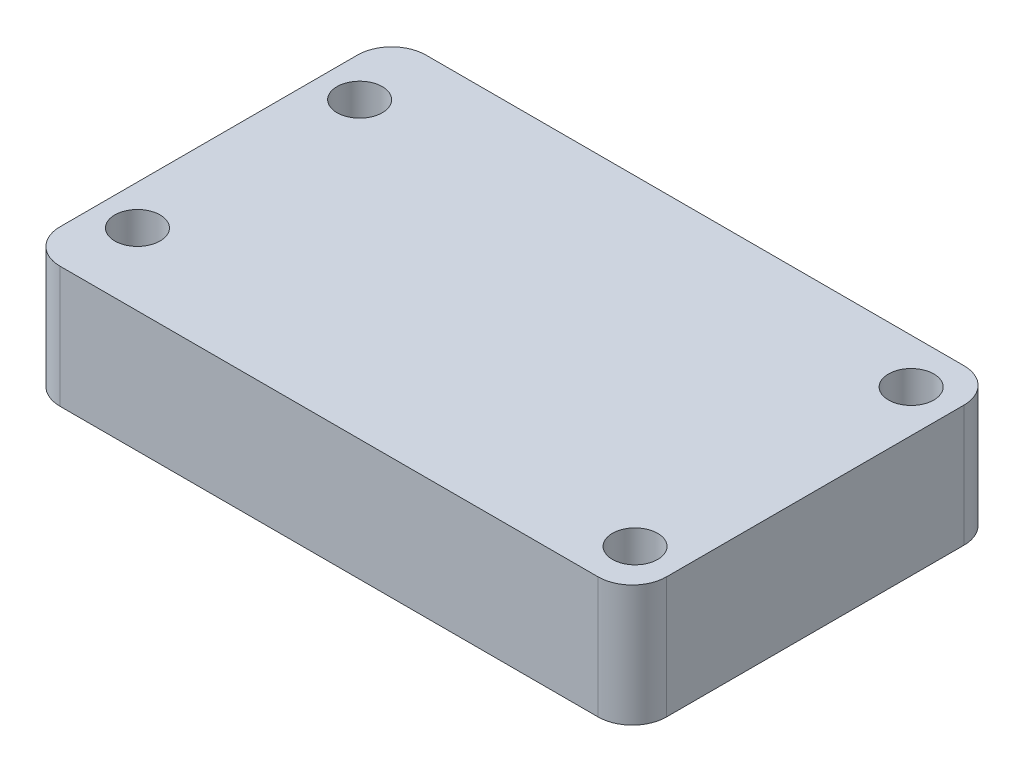
ISO-10303-21;
HEADER;
FILE_DESCRIPTION(('STEP AP214'),'2;1');
FILE_NAME('part.step','',(''),(''),'','','');
FILE_SCHEMA(('AUTOMOTIVE_DESIGN { 1 0 10303 214 1 1 1 1 }'));
ENDSEC;
DATA;
#1=APPLICATION_CONTEXT('core data for automotive mechanical design processes');
#2=APPLICATION_PROTOCOL_DEFINITION('international standard','automotive_design',2000,#1);
#3=PRODUCT_CONTEXT('',#1,'mechanical');
#4=PRODUCT('Part','Part','',(#3));
#5=PRODUCT_RELATED_PRODUCT_CATEGORY('part','',(#4));
#6=PRODUCT_DEFINITION_FORMATION('','',#4);
#7=PRODUCT_DEFINITION_CONTEXT('part definition',#1,'design');
#8=PRODUCT_DEFINITION('design','',#6,#7);
#9=PRODUCT_DEFINITION_SHAPE('','',#8);
#10=(LENGTH_UNIT() NAMED_UNIT(*) SI_UNIT(.MILLI.,.METRE.));
#11=(NAMED_UNIT(*) PLANE_ANGLE_UNIT() SI_UNIT($,.RADIAN.));
#12=(NAMED_UNIT(*) SI_UNIT($,.STERADIAN.) SOLID_ANGLE_UNIT());
#13=UNCERTAINTY_MEASURE_WITH_UNIT(LENGTH_MEASURE(1.E-05),#10,'distance_accuracy_value','');
#14=(GEOMETRIC_REPRESENTATION_CONTEXT(3) GLOBAL_UNCERTAINTY_ASSIGNED_CONTEXT((#13)) GLOBAL_UNIT_ASSIGNED_CONTEXT((#10,
#11,#12)) REPRESENTATION_CONTEXT('',''));
#15=CARTESIAN_POINT('',(0.,0.,0.));
#16=DIRECTION('',(0.,0.,1.));
#17=DIRECTION('',(1.,0.,0.));
#18=AXIS2_PLACEMENT_3D('',#15,#16,#17);
#19=CARTESIAN_POINT('',(-91.4484356685208,7.2136,9.35669322477144));
#20=DIRECTION('',(1.,0.,0.));
#21=DIRECTION('',(0.,0.,-1.));
#22=AXIS2_PLACEMENT_3D('',#19,#20,#21);
#23=PLANE('',#22);
#24=DIRECTION('',(0.,0.,1.));
#25=VECTOR('',#24,1.);
#26=CARTESIAN_POINT('',(-91.4484356685208,0.,9.35669322477144));
#27=LINE('',#26,#25);
#28=CARTESIAN_POINT('',(-91.4484356685208,0.,-10.3537067752286));
#29=VERTEX_POINT('',#28);
#30=CARTESIAN_POINT('',(-91.4484356685208,0.,7.32469322477144));
#31=VERTEX_POINT('',#30);
#32=EDGE_CURVE('E128',#29,#31,#27,.T.);
#33=ORIENTED_EDGE('',*,*,#32,.T.);
#34=DIRECTION('',(0.,-1.,0.));
#35=VECTOR('',#34,1.);
#36=CARTESIAN_POINT('',(-91.4484356685208,7.2136,7.32469322477144));
#37=LINE('',#36,#35);
#38=CARTESIAN_POINT('',(-91.4484356685208,7.2136,7.32469322477144));
#39=VERTEX_POINT('',#38);
#40=EDGE_CURVE('E11',#31,#39,#37,.F.);
#41=ORIENTED_EDGE('',*,*,#40,.T.);
#42=DIRECTION('',(0.,0.,1.));
#43=VECTOR('',#42,1.);
#44=CARTESIAN_POINT('',(-91.4484356685208,7.2136,9.35669322477144));
#45=LINE('',#44,#43);
#46=CARTESIAN_POINT('',(-91.4484356685208,7.2136,-10.3537067752286));
#47=VERTEX_POINT('',#46);
#48=EDGE_CURVE('E126',#47,#39,#45,.T.);
#49=ORIENTED_EDGE('',*,*,#48,.F.);
#50=DIRECTION('',(0.,-1.,0.));
#51=VECTOR('',#50,1.);
#52=CARTESIAN_POINT('',(-91.4484356685208,7.2136,-10.3537067752286));
#53=LINE('',#52,#51);
#54=EDGE_CURVE('E40',#47,#29,#53,.T.);
#55=ORIENTED_EDGE('',*,*,#54,.T.);
#56=EDGE_LOOP('',(#33,#41,#49,#55));
#57=FACE_BOUND('',#56,.T.);
#58=ADVANCED_FACE('F32',(#57),#23,.F.);
#59=CARTESIAN_POINT('',(-91.4484356685208,7.2136,9.35669322477144));
#60=DIRECTION('',(0.,0.,-1.));
#61=DIRECTION('',(-1.,0.,0.));
#62=AXIS2_PLACEMENT_3D('',#59,#60,#61);
#63=PLANE('',#62);
#64=DIRECTION('',(1.,0.,0.));
#65=VECTOR('',#64,1.);
#66=CARTESIAN_POINT('',(-91.4484356685208,0.,9.35669322477144));
#67=LINE('',#66,#65);
#68=CARTESIAN_POINT('',(-89.4164356685208,0.,9.35669322477144));
#69=VERTEX_POINT('',#68);
#70=CARTESIAN_POINT('',(-57.4378356685208,0.,9.35669322477144));
#71=VERTEX_POINT('',#70);
#72=EDGE_CURVE('E124',#69,#71,#67,.T.);
#73=ORIENTED_EDGE('',*,*,#72,.T.);
#74=DIRECTION('',(0.,-1.,0.));
#75=VECTOR('',#74,1.);
#76=CARTESIAN_POINT('',(-57.4378356685208,7.2136,9.35669322477144));
#77=LINE('',#76,#75);
#78=CARTESIAN_POINT('',(-57.4378356685208,7.2136,9.35669322477144));
#79=VERTEX_POINT('',#78);
#80=EDGE_CURVE('E103',#71,#79,#77,.F.);
#81=ORIENTED_EDGE('',*,*,#80,.T.);
#82=DIRECTION('',(1.,0.,0.));
#83=VECTOR('',#82,1.);
#84=CARTESIAN_POINT('',(-91.4484356685208,7.2136,9.35669322477144));
#85=LINE('',#84,#83);
#86=CARTESIAN_POINT('',(-89.4164356685208,7.2136,9.35669322477144));
#87=VERTEX_POINT('',#86);
#88=EDGE_CURVE('E168',#87,#79,#85,.T.);
#89=ORIENTED_EDGE('',*,*,#88,.F.);
#90=DIRECTION('',(0.,-1.,0.));
#91=VECTOR('',#90,1.);
#92=CARTESIAN_POINT('',(-89.4164356685208,7.2136,9.35669322477144));
#93=LINE('',#92,#91);
#94=EDGE_CURVE('E108',#87,#69,#93,.T.);
#95=ORIENTED_EDGE('',*,*,#94,.T.);
#96=EDGE_LOOP('',(#73,#81,#89,#95));
#97=FACE_BOUND('',#96,.T.);
#98=ADVANCED_FACE('F216',(#97),#63,.F.);
#99=CARTESIAN_POINT('',(-55.4058356685208,7.2136,9.35669322477144));
#100=DIRECTION('',(-1.,0.,0.));
#101=DIRECTION('',(0.,0.,1.));
#102=AXIS2_PLACEMENT_3D('',#99,#100,#101);
#103=PLANE('',#102);
#104=DIRECTION('',(0.,0.,-1.));
#105=VECTOR('',#104,1.);
#106=CARTESIAN_POINT('',(-55.4058356685208,7.2136,9.35669322477144));
#107=LINE('',#106,#105);
#108=CARTESIAN_POINT('',(-55.4058356685208,7.2136,7.32469322477144));
#109=VERTEX_POINT('',#108);
#110=CARTESIAN_POINT('',(-55.4058356685208,7.2136,-10.3537067752286));
#111=VERTEX_POINT('',#110);
#112=EDGE_CURVE('E117',#109,#111,#107,.T.);
#113=ORIENTED_EDGE('',*,*,#112,.F.);
#114=DIRECTION('',(0.,-1.,0.));
#115=VECTOR('',#114,1.);
#116=CARTESIAN_POINT('',(-55.4058356685208,7.2136,7.32469322477144));
#117=LINE('',#116,#115);
#118=CARTESIAN_POINT('',(-55.4058356685208,0.,7.32469322477144));
#119=VERTEX_POINT('',#118);
#120=EDGE_CURVE('E102',#109,#119,#117,.T.);
#121=ORIENTED_EDGE('',*,*,#120,.T.);
#122=DIRECTION('',(0.,0.,-1.));
#123=VECTOR('',#122,1.);
#124=CARTESIAN_POINT('',(-55.4058356685208,0.,9.35669322477144));
#125=LINE('',#124,#123);
#126=CARTESIAN_POINT('',(-55.4058356685208,0.,-10.3537067752286));
#127=VERTEX_POINT('',#126);
#128=EDGE_CURVE('E115',#119,#127,#125,.T.);
#129=ORIENTED_EDGE('',*,*,#128,.T.);
#130=DIRECTION('',(0.,-1.,0.));
#131=VECTOR('',#130,1.);
#132=CARTESIAN_POINT('',(-55.4058356685208,7.2136,-10.3537067752286));
#133=LINE('',#132,#131);
#134=EDGE_CURVE('E119',#127,#111,#133,.F.);
#135=ORIENTED_EDGE('',*,*,#134,.T.);
#136=EDGE_LOOP('',(#113,#121,#129,#135));
#137=FACE_BOUND('',#136,.T.);
#138=ADVANCED_FACE('F114',(#137),#103,.F.);
#139=CARTESIAN_POINT('',(-91.4484356685208,7.2136,-12.3857067752286));
#140=DIRECTION('',(0.,0.,1.));
#141=DIRECTION('',(1.,0.,0.));
#142=AXIS2_PLACEMENT_3D('',#139,#140,#141);
#143=PLANE('',#142);
#144=DIRECTION('',(-1.,0.,0.));
#145=VECTOR('',#144,1.);
#146=CARTESIAN_POINT('',(-91.4484356685208,7.2136,-12.3857067752286));
#147=LINE('',#146,#145);
#148=CARTESIAN_POINT('',(-57.4378356685208,7.2136,-12.3857067752286));
#149=VERTEX_POINT('',#148);
#150=CARTESIAN_POINT('',(-89.4164356685208,7.2136,-12.3857067752286));
#151=VERTEX_POINT('',#150);
#152=EDGE_CURVE('E132',#149,#151,#147,.T.);
#153=ORIENTED_EDGE('',*,*,#152,.F.);
#154=DIRECTION('',(0.,-1.,0.));
#155=VECTOR('',#154,1.);
#156=CARTESIAN_POINT('',(-57.4378356685208,7.2136,-12.3857067752286));
#157=LINE('',#156,#155);
#158=CARTESIAN_POINT('',(-57.4378356685208,0.,-12.3857067752286));
#159=VERTEX_POINT('',#158);
#160=EDGE_CURVE('E149',#149,#159,#157,.T.);
#161=ORIENTED_EDGE('',*,*,#160,.T.);
#162=DIRECTION('',(-1.,0.,0.));
#163=VECTOR('',#162,1.);
#164=CARTESIAN_POINT('',(-91.4484356685208,0.,-12.3857067752286));
#165=LINE('',#164,#163);
#166=CARTESIAN_POINT('',(-89.4164356685208,0.,-12.3857067752286));
#167=VERTEX_POINT('',#166);
#168=EDGE_CURVE('E123',#159,#167,#165,.T.);
#169=ORIENTED_EDGE('',*,*,#168,.T.);
#170=DIRECTION('',(0.,-1.,0.));
#171=VECTOR('',#170,1.);
#172=CARTESIAN_POINT('',(-89.4164356685208,7.2136,-12.3857067752286));
#173=LINE('',#172,#171);
#174=EDGE_CURVE('E47',#167,#151,#173,.F.);
#175=ORIENTED_EDGE('',*,*,#174,.T.);
#176=EDGE_LOOP('',(#153,#161,#169,#175));
#177=FACE_BOUND('',#176,.T.);
#178=ADVANCED_FACE('F205',(#177),#143,.F.);
#179=CARTESIAN_POINT('',(0.,7.2136,0.));
#180=DIRECTION('',(0.,-1.,0.));
#181=DIRECTION('',(0.,0.,-1.));
#182=AXIS2_PLACEMENT_3D('',#179,#180,#181);
#183=PLANE('',#182);
#184=CARTESIAN_POINT('',(-89.0862356685208,7.2136,5.08949322477144));
#185=DIRECTION('',(0.,1.,0.));
#186=DIRECTION('',(0.,0.,-1.));
#187=AXIS2_PLACEMENT_3D('',#184,#185,#186);
#188=CIRCLE('',#187,1.3462);
#189=CARTESIAN_POINT('',(-89.0862356685208,7.2136,3.74329322477144));
#190=VERTEX_POINT('',#189);
#191=EDGE_CURVE('E187',#190,#190,#188,.T.);
#192=ORIENTED_EDGE('',*,*,#191,.F.);
#193=EDGE_LOOP('',(#192));
#194=FACE_BOUND('',#193,.T.);
#195=CARTESIAN_POINT('',(-57.9077356685208,7.2136,6.68969322477144));
#196=DIRECTION('',(0.,1.,0.));
#197=DIRECTION('',(0.,0.,-1.));
#198=AXIS2_PLACEMENT_3D('',#195,#196,#197);
#199=CIRCLE('',#198,1.3462);
#200=CARTESIAN_POINT('',(-57.9077356685208,7.2136,5.34349322477144));
#201=VERTEX_POINT('',#200);
#202=EDGE_CURVE('E181',#201,#201,#199,.T.);
#203=ORIENTED_EDGE('',*,*,#202,.F.);
#204=EDGE_LOOP('',(#203));
#205=FACE_BOUND('',#204,.T.);
#206=CARTESIAN_POINT('',(-89.0862356685208,7.2136,-8.11850677522856));
#207=DIRECTION('',(0.,1.,0.));
#208=DIRECTION('',(0.,0.,1.));
#209=AXIS2_PLACEMENT_3D('',#206,#207,#208);
#210=CIRCLE('',#209,1.3462);
#211=CARTESIAN_POINT('',(-89.0862356685208,7.2136,-6.77230677522856));
#212=VERTEX_POINT('',#211);
#213=EDGE_CURVE('E175',#212,#212,#210,.T.);
#214=ORIENTED_EDGE('',*,*,#213,.F.);
#215=EDGE_LOOP('',(#214));
#216=FACE_BOUND('',#215,.T.);
#217=CARTESIAN_POINT('',(-57.9077356685208,7.2136,-9.71870677522856));
#218=DIRECTION('',(0.,1.,0.));
#219=DIRECTION('',(0.,0.,1.));
#220=AXIS2_PLACEMENT_3D('',#217,#218,#219);
#221=CIRCLE('',#220,1.3462);
#222=CARTESIAN_POINT('',(-57.9077356685208,7.2136,-8.37250677522856));
#223=VERTEX_POINT('',#222);
#224=EDGE_CURVE('E163',#223,#223,#221,.T.);
#225=ORIENTED_EDGE('',*,*,#224,.F.);
#226=EDGE_LOOP('',(#225));
#227=FACE_BOUND('',#226,.T.);
#228=ORIENTED_EDGE('',*,*,#88,.T.);
#229=CARTESIAN_POINT('',(-57.4378356685208,7.2136,7.32469322477144));
#230=DIRECTION('',(0.,-1.,0.));
#231=DIRECTION('',(0.,0.,-1.));
#232=AXIS2_PLACEMENT_3D('',#229,#230,#231);
#233=CIRCLE('',#232,2.032);
#234=EDGE_CURVE('E146',#79,#109,#233,.F.);
#235=ORIENTED_EDGE('',*,*,#234,.T.);
#236=ORIENTED_EDGE('',*,*,#112,.T.);
#237=CARTESIAN_POINT('',(-57.4378356685208,7.2136,-10.3537067752286));
#238=DIRECTION('',(0.,-1.,0.));
#239=DIRECTION('',(0.,0.,-1.));
#240=AXIS2_PLACEMENT_3D('',#237,#238,#239);
#241=CIRCLE('',#240,2.032);
#242=EDGE_CURVE('E54',#111,#149,#241,.F.);
#243=ORIENTED_EDGE('',*,*,#242,.T.);
#244=ORIENTED_EDGE('',*,*,#152,.T.);
#245=CARTESIAN_POINT('',(-89.4164356685208,7.2136,-10.3537067752286));
#246=DIRECTION('',(0.,-1.,0.));
#247=DIRECTION('',(0.,0.,-1.));
#248=AXIS2_PLACEMENT_3D('',#245,#246,#247);
#249=CIRCLE('',#248,2.032);
#250=EDGE_CURVE('E141',#151,#47,#249,.F.);
#251=ORIENTED_EDGE('',*,*,#250,.T.);
#252=ORIENTED_EDGE('',*,*,#48,.T.);
#253=CARTESIAN_POINT('',(-89.4164356685208,7.2136,7.32469322477144));
#254=DIRECTION('',(0.,-1.,0.));
#255=DIRECTION('',(0.,0.,-1.));
#256=AXIS2_PLACEMENT_3D('',#253,#254,#255);
#257=CIRCLE('',#256,2.032);
#258=EDGE_CURVE('E143',#39,#87,#257,.F.);
#259=ORIENTED_EDGE('',*,*,#258,.T.);
#260=EDGE_LOOP('',(#228,#235,#236,#243,#244,#251,#252,#259));
#261=FACE_BOUND('',#260,.T.);
#262=ADVANCED_FACE('F202',(#194,#205,#216,#227,#261),#183,.F.);
#263=CARTESIAN_POINT('',(0.,0.,0.));
#264=DIRECTION('',(0.,-1.,0.));
#265=DIRECTION('',(0.,0.,-1.));
#266=AXIS2_PLACEMENT_3D('',#263,#264,#265);
#267=PLANE('',#266);
#268=CARTESIAN_POINT('',(-89.0862356685208,0.,5.08949322477144));
#269=DIRECTION('',(0.,1.,0.));
#270=DIRECTION('',(0.,0.,-1.));
#271=AXIS2_PLACEMENT_3D('',#268,#269,#270);
#272=CIRCLE('',#271,1.3462);
#273=CARTESIAN_POINT('',(-89.0862356685208,0.,3.74329322477144));
#274=VERTEX_POINT('',#273);
#275=EDGE_CURVE('E184',#274,#274,#272,.T.);
#276=ORIENTED_EDGE('',*,*,#275,.T.);
#277=EDGE_LOOP('',(#276));
#278=FACE_BOUND('',#277,.T.);
#279=CARTESIAN_POINT('',(-57.9077356685208,0.,6.68969322477144));
#280=DIRECTION('',(0.,1.,0.));
#281=DIRECTION('',(0.,0.,-1.));
#282=AXIS2_PLACEMENT_3D('',#279,#280,#281);
#283=CIRCLE('',#282,1.3462);
#284=CARTESIAN_POINT('',(-57.9077356685208,0.,5.34349322477144));
#285=VERTEX_POINT('',#284);
#286=EDGE_CURVE('E178',#285,#285,#283,.T.);
#287=ORIENTED_EDGE('',*,*,#286,.T.);
#288=EDGE_LOOP('',(#287));
#289=FACE_BOUND('',#288,.T.);
#290=CARTESIAN_POINT('',(-89.0862356685208,0.,-8.11850677522856));
#291=DIRECTION('',(0.,1.,0.));
#292=DIRECTION('',(0.,0.,1.));
#293=AXIS2_PLACEMENT_3D('',#290,#291,#292);
#294=CIRCLE('',#293,1.3462);
#295=CARTESIAN_POINT('',(-89.0862356685208,0.,-6.77230677522856));
#296=VERTEX_POINT('',#295);
#297=EDGE_CURVE('E173',#296,#296,#294,.T.);
#298=ORIENTED_EDGE('',*,*,#297,.T.);
#299=EDGE_LOOP('',(#298));
#300=FACE_BOUND('',#299,.T.);
#301=CARTESIAN_POINT('',(-57.9077356685208,0.,-9.71870677522856));
#302=DIRECTION('',(0.,1.,0.));
#303=DIRECTION('',(0.,0.,1.));
#304=AXIS2_PLACEMENT_3D('',#301,#302,#303);
#305=CIRCLE('',#304,1.3462);
#306=CARTESIAN_POINT('',(-57.9077356685208,0.,-8.37250677522856));
#307=VERTEX_POINT('',#306);
#308=EDGE_CURVE('E161',#307,#307,#305,.T.);
#309=ORIENTED_EDGE('',*,*,#308,.T.);
#310=EDGE_LOOP('',(#309));
#311=FACE_BOUND('',#310,.T.);
#312=ORIENTED_EDGE('',*,*,#128,.F.);
#313=CARTESIAN_POINT('',(-57.4378356685208,0.,7.32469322477144));
#314=DIRECTION('',(0.,-1.,0.));
#315=DIRECTION('',(0.,0.,-1.));
#316=AXIS2_PLACEMENT_3D('',#313,#314,#315);
#317=CIRCLE('',#316,2.032);
#318=EDGE_CURVE('E98',#119,#71,#317,.T.);
#319=ORIENTED_EDGE('',*,*,#318,.T.);
#320=ORIENTED_EDGE('',*,*,#72,.F.);
#321=CARTESIAN_POINT('',(-89.4164356685208,0.,7.32469322477144));
#322=DIRECTION('',(0.,-1.,0.));
#323=DIRECTION('',(0.,0.,-1.));
#324=AXIS2_PLACEMENT_3D('',#321,#322,#323);
#325=CIRCLE('',#324,2.032);
#326=EDGE_CURVE('E135',#69,#31,#325,.T.);
#327=ORIENTED_EDGE('',*,*,#326,.T.);
#328=ORIENTED_EDGE('',*,*,#32,.F.);
#329=CARTESIAN_POINT('',(-89.4164356685208,0.,-10.3537067752286));
#330=DIRECTION('',(0.,-1.,0.));
#331=DIRECTION('',(0.,0.,-1.));
#332=AXIS2_PLACEMENT_3D('',#329,#330,#331);
#333=CIRCLE('',#332,2.032);
#334=EDGE_CURVE('E118',#29,#167,#333,.T.);
#335=ORIENTED_EDGE('',*,*,#334,.T.);
#336=ORIENTED_EDGE('',*,*,#168,.F.);
#337=CARTESIAN_POINT('',(-57.4378356685208,0.,-10.3537067752286));
#338=DIRECTION('',(0.,-1.,0.));
#339=DIRECTION('',(0.,0.,-1.));
#340=AXIS2_PLACEMENT_3D('',#337,#338,#339);
#341=CIRCLE('',#340,2.032);
#342=EDGE_CURVE('E109',#159,#127,#341,.T.);
#343=ORIENTED_EDGE('',*,*,#342,.T.);
#344=EDGE_LOOP('',(#312,#319,#320,#327,#328,#335,#336,#343));
#345=FACE_BOUND('',#344,.T.);
#346=ADVANCED_FACE('F121',(#278,#289,#300,#311,#345),#267,.T.);
#347=CARTESIAN_POINT('',(-57.9077356685208,0.,-9.71870677522856));
#348=DIRECTION('',(0.,1.,0.));
#349=DIRECTION('',(0.,0.,1.));
#350=AXIS2_PLACEMENT_3D('',#347,#348,#349);
#351=CYLINDRICAL_SURFACE('',#350,1.3462);
#352=ORIENTED_EDGE('',*,*,#308,.F.);
#353=EDGE_LOOP('',(#352));
#354=FACE_BOUND('',#353,.T.);
#355=ORIENTED_EDGE('',*,*,#224,.T.);
#356=EDGE_LOOP('',(#355));
#357=FACE_BOUND('',#356,.T.);
#358=ADVANCED_FACE('F246',(#354,#357),#351,.F.);
#359=CARTESIAN_POINT('',(-89.0862356685208,0.,-8.11850677522856));
#360=DIRECTION('',(0.,1.,0.));
#361=DIRECTION('',(0.,0.,1.));
#362=AXIS2_PLACEMENT_3D('',#359,#360,#361);
#363=CYLINDRICAL_SURFACE('',#362,1.3462);
#364=ORIENTED_EDGE('',*,*,#297,.F.);
#365=EDGE_LOOP('',(#364));
#366=FACE_BOUND('',#365,.T.);
#367=ORIENTED_EDGE('',*,*,#213,.T.);
#368=EDGE_LOOP('',(#367));
#369=FACE_BOUND('',#368,.T.);
#370=ADVANCED_FACE('F250',(#366,#369),#363,.F.);
#371=CARTESIAN_POINT('',(-57.9077356685208,0.,6.68969322477144));
#372=DIRECTION('',(0.,1.,0.));
#373=DIRECTION('',(0.,0.,1.));
#374=AXIS2_PLACEMENT_3D('',#371,#372,#373);
#375=CYLINDRICAL_SURFACE('',#374,1.3462);
#376=ORIENTED_EDGE('',*,*,#286,.F.);
#377=EDGE_LOOP('',(#376));
#378=FACE_BOUND('',#377,.T.);
#379=ORIENTED_EDGE('',*,*,#202,.T.);
#380=EDGE_LOOP('',(#379));
#381=FACE_BOUND('',#380,.T.);
#382=ADVANCED_FACE('F198',(#378,#381),#375,.F.);
#383=CARTESIAN_POINT('',(-89.0862356685208,0.,5.08949322477144));
#384=DIRECTION('',(0.,1.,0.));
#385=DIRECTION('',(0.,0.,1.));
#386=AXIS2_PLACEMENT_3D('',#383,#384,#385);
#387=CYLINDRICAL_SURFACE('',#386,1.3462);
#388=ORIENTED_EDGE('',*,*,#275,.F.);
#389=EDGE_LOOP('',(#388));
#390=FACE_BOUND('',#389,.T.);
#391=ORIENTED_EDGE('',*,*,#191,.T.);
#392=EDGE_LOOP('',(#391));
#393=FACE_BOUND('',#392,.T.);
#394=ADVANCED_FACE('F195',(#390,#393),#387,.F.);
#395=CARTESIAN_POINT('',(-57.4378356685208,7.2136,7.32469322477144));
#396=DIRECTION('',(0.,-1.,0.));
#397=DIRECTION('',(0.,0.,-1.));
#398=AXIS2_PLACEMENT_3D('',#395,#396,#397);
#399=CYLINDRICAL_SURFACE('',#398,2.032);
#400=ORIENTED_EDGE('',*,*,#234,.F.);
#401=ORIENTED_EDGE('',*,*,#80,.F.);
#402=ORIENTED_EDGE('',*,*,#318,.F.);
#403=ORIENTED_EDGE('',*,*,#120,.F.);
#404=EDGE_LOOP('',(#400,#401,#402,#403));
#405=FACE_BOUND('',#404,.T.);
#406=ADVANCED_FACE('F101',(#405),#399,.T.);
#407=CARTESIAN_POINT('',(-57.4378356685208,7.2136,-10.3537067752286));
#408=DIRECTION('',(0.,-1.,0.));
#409=DIRECTION('',(0.,0.,-1.));
#410=AXIS2_PLACEMENT_3D('',#407,#408,#409);
#411=CYLINDRICAL_SURFACE('',#410,2.032);
#412=ORIENTED_EDGE('',*,*,#242,.F.);
#413=ORIENTED_EDGE('',*,*,#134,.F.);
#414=ORIENTED_EDGE('',*,*,#342,.F.);
#415=ORIENTED_EDGE('',*,*,#160,.F.);
#416=EDGE_LOOP('',(#412,#413,#414,#415));
#417=FACE_BOUND('',#416,.T.);
#418=ADVANCED_FACE('F223',(#417),#411,.T.);
#419=CARTESIAN_POINT('',(-89.4164356685208,7.2136,7.32469322477144));
#420=DIRECTION('',(0.,-1.,0.));
#421=DIRECTION('',(0.,0.,-1.));
#422=AXIS2_PLACEMENT_3D('',#419,#420,#421);
#423=CYLINDRICAL_SURFACE('',#422,2.032);
#424=ORIENTED_EDGE('',*,*,#258,.F.);
#425=ORIENTED_EDGE('',*,*,#40,.F.);
#426=ORIENTED_EDGE('',*,*,#326,.F.);
#427=ORIENTED_EDGE('',*,*,#94,.F.);
#428=EDGE_LOOP('',(#424,#425,#426,#427));
#429=FACE_BOUND('',#428,.T.);
#430=ADVANCED_FACE('F218',(#429),#423,.T.);
#431=CARTESIAN_POINT('',(-89.4164356685208,7.2136,-10.3537067752286));
#432=DIRECTION('',(0.,-1.,0.));
#433=DIRECTION('',(0.,0.,-1.));
#434=AXIS2_PLACEMENT_3D('',#431,#432,#433);
#435=CYLINDRICAL_SURFACE('',#434,2.032);
#436=ORIENTED_EDGE('',*,*,#250,.F.);
#437=ORIENTED_EDGE('',*,*,#174,.F.);
#438=ORIENTED_EDGE('',*,*,#334,.F.);
#439=ORIENTED_EDGE('',*,*,#54,.F.);
#440=EDGE_LOOP('',(#436,#437,#438,#439));
#441=FACE_BOUND('',#440,.T.);
#442=ADVANCED_FACE('F34',(#441),#435,.T.);
#443=CLOSED_SHELL('',(#58,#98,#138,#178,#262,#346,#358,#370,#382,#394,#406,#418,#430,#442));
#444=MANIFOLD_SOLID_BREP('B2',#443);
#445=ADVANCED_BREP_SHAPE_REPRESENTATION('',(#18,#444),#14);
#446=SHAPE_DEFINITION_REPRESENTATION(#9,#445);
ENDSEC;
END-ISO-10303-21;
